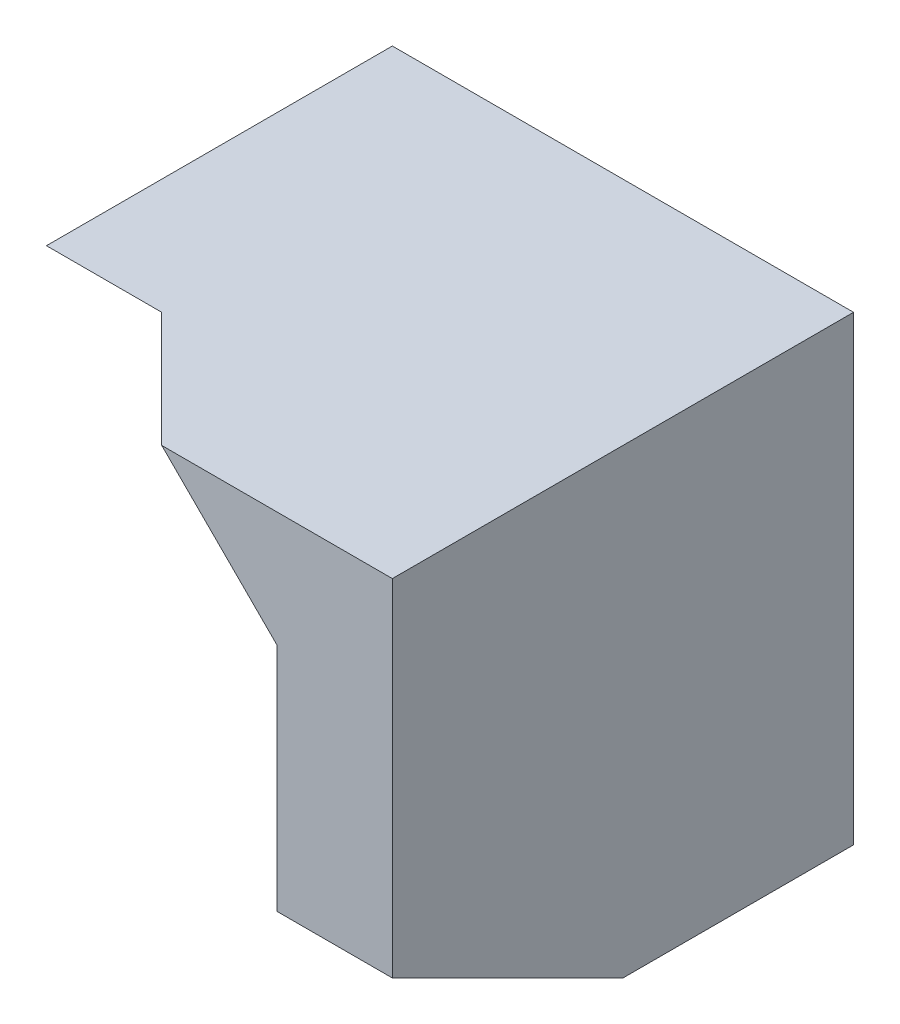
ISO-10303-21;
HEADER;
FILE_DESCRIPTION(('STEP AP214'),'2;1');
FILE_NAME('part.step','',(''),(''),'','','');
FILE_SCHEMA(('AUTOMOTIVE_DESIGN { 1 0 10303 214 1 1 1 1 }'));
ENDSEC;
DATA;
#1=APPLICATION_CONTEXT('core data for automotive mechanical design processes');
#2=APPLICATION_PROTOCOL_DEFINITION('international standard','automotive_design',2000,#1);
#3=PRODUCT_CONTEXT('',#1,'mechanical');
#4=PRODUCT('Part','Part','',(#3));
#5=PRODUCT_RELATED_PRODUCT_CATEGORY('part','',(#4));
#6=PRODUCT_DEFINITION_FORMATION('','',#4);
#7=PRODUCT_DEFINITION_CONTEXT('part definition',#1,'design');
#8=PRODUCT_DEFINITION('design','',#6,#7);
#9=PRODUCT_DEFINITION_SHAPE('','',#8);
#10=(LENGTH_UNIT() NAMED_UNIT(*) SI_UNIT(.MILLI.,.METRE.));
#11=(NAMED_UNIT(*) PLANE_ANGLE_UNIT() SI_UNIT($,.RADIAN.));
#12=(NAMED_UNIT(*) SI_UNIT($,.STERADIAN.) SOLID_ANGLE_UNIT());
#13=UNCERTAINTY_MEASURE_WITH_UNIT(LENGTH_MEASURE(1.E-05),#10,'distance_accuracy_value','');
#14=(GEOMETRIC_REPRESENTATION_CONTEXT(3) GLOBAL_UNCERTAINTY_ASSIGNED_CONTEXT((#13)) GLOBAL_UNIT_ASSIGNED_CONTEXT((#10,
#11,#12)) REPRESENTATION_CONTEXT('',''));
#15=CARTESIAN_POINT('',(0.,0.,0.));
#16=DIRECTION('',(0.,0.,1.));
#17=DIRECTION('',(1.,0.,0.));
#18=AXIS2_PLACEMENT_3D('',#15,#16,#17);
#19=CARTESIAN_POINT('',(30.,40.,40.));
#20=DIRECTION('',(0.,0.,1.));
#21=DIRECTION('',(0.,-1.,0.));
#22=AXIS2_PLACEMENT_3D('',#19,#20,#21);
#23=PLANE('',#22);
#24=DIRECTION('',(1.,0.,0.));
#25=VECTOR('',#24,1.);
#26=CARTESIAN_POINT('',(30.,40.,40.));
#27=LINE('',#26,#25);
#28=CARTESIAN_POINT('',(20.,40.,40.));
#29=VERTEX_POINT('',#28);
#30=CARTESIAN_POINT('',(40.,40.,40.));
#31=VERTEX_POINT('',#30);
#32=EDGE_CURVE('E156',#29,#31,#27,.T.);
#33=ORIENTED_EDGE('',*,*,#32,.F.);
#34=DIRECTION('',(0.707106781186547,-0.707106781186548,0.));
#35=VECTOR('',#34,1.);
#36=CARTESIAN_POINT('',(20.,40.,40.));
#37=LINE('',#36,#35);
#38=CARTESIAN_POINT('',(30.,30.,40.));
#39=VERTEX_POINT('',#38);
#40=EDGE_CURVE('E142',#29,#39,#37,.T.);
#41=ORIENTED_EDGE('',*,*,#40,.T.);
#42=DIRECTION('',(0.,-1.,0.));
#43=VECTOR('',#42,1.);
#44=CARTESIAN_POINT('',(30.,40.,40.));
#45=LINE('',#44,#43);
#46=CARTESIAN_POINT('',(30.,10.,40.));
#47=VERTEX_POINT('',#46);
#48=EDGE_CURVE('E150',#39,#47,#45,.T.);
#49=ORIENTED_EDGE('',*,*,#48,.T.);
#50=DIRECTION('',(1.,0.,0.));
#51=VECTOR('',#50,1.);
#52=CARTESIAN_POINT('',(30.,10.,40.));
#53=LINE('',#52,#51);
#54=CARTESIAN_POINT('',(40.,10.,40.));
#55=VERTEX_POINT('',#54);
#56=EDGE_CURVE('E223',#47,#55,#53,.T.);
#57=ORIENTED_EDGE('',*,*,#56,.T.);
#58=DIRECTION('',(0.,-1.,0.));
#59=VECTOR('',#58,1.);
#60=CARTESIAN_POINT('',(40.,40.,40.));
#61=LINE('',#60,#59);
#62=EDGE_CURVE('E161',#31,#55,#61,.T.);
#63=ORIENTED_EDGE('',*,*,#62,.F.);
#64=EDGE_LOOP('',(#33,#41,#49,#57,#63));
#65=FACE_BOUND('',#64,.T.);
#66=ADVANCED_FACE('F36',(#65),#23,.T.);
#67=CARTESIAN_POINT('',(6.66666666666667,6.66666666666666,-6.66666666666666));
#68=DIRECTION('',(-0.577350269189626,-0.577350269189626,0.577350269189626));
#69=DIRECTION('',(0.707106781186547,0.,0.707106781186548));
#70=AXIS2_PLACEMENT_3D('',#67,#68,#69);
#71=PLANE('',#70);
#72=ORIENTED_EDGE('',*,*,#40,.F.);
#73=DIRECTION('',(-0.707106781186547,0.,-0.707106781186547));
#74=VECTOR('',#73,1.);
#75=CARTESIAN_POINT('',(20.,40.,40.));
#76=LINE('',#75,#74);
#77=CARTESIAN_POINT('',(9.99999999999999,40.,30.));
#78=VERTEX_POINT('',#77);
#79=EDGE_CURVE('E46',#29,#78,#76,.T.);
#80=ORIENTED_EDGE('',*,*,#79,.T.);
#81=DIRECTION('',(0.,-0.707106781186548,-0.707106781186548));
#82=VECTOR('',#81,1.);
#83=CARTESIAN_POINT('',(10.,40.,30.));
#84=LINE('',#83,#82);
#85=CARTESIAN_POINT('',(9.99999999999999,30.,20.));
#86=VERTEX_POINT('',#85);
#87=EDGE_CURVE('E12',#78,#86,#84,.T.);
#88=ORIENTED_EDGE('',*,*,#87,.T.);
#89=DIRECTION('',(-0.707106781186548,0.707106781186548,0.));
#90=VECTOR('',#89,1.);
#91=CARTESIAN_POINT('',(10.,30.,20.));
#92=LINE('',#91,#90);
#93=CARTESIAN_POINT('',(20.,20.,20.));
#94=VERTEX_POINT('',#93);
#95=EDGE_CURVE('E197',#94,#86,#92,.T.);
#96=ORIENTED_EDGE('',*,*,#95,.F.);
#97=DIRECTION('',(-0.707106781186548,0.707106781186546,0.));
#98=VECTOR('',#97,1.);
#99=CARTESIAN_POINT('',(10.,30.,20.));
#100=LINE('',#99,#98);
#101=CARTESIAN_POINT('',(29.9999999999999,10.0000000000001,20.0000000000001));
#102=VERTEX_POINT('',#101);
#103=EDGE_CURVE('E217',#102,#94,#100,.T.);
#104=ORIENTED_EDGE('',*,*,#103,.F.);
#105=DIRECTION('',(0.,-0.707106781186546,-0.707106781186549));
#106=VECTOR('',#105,1.);
#107=CARTESIAN_POINT('',(29.9999999999999,10.0000000000001,20.0000000000001));
#108=LINE('',#107,#106);
#109=EDGE_CURVE('E146',#39,#102,#108,.T.);
#110=ORIENTED_EDGE('',*,*,#109,.F.);
#111=EDGE_LOOP('',(#72,#80,#88,#96,#104,#110));
#112=FACE_BOUND('',#111,.T.);
#113=ADVANCED_FACE('F144',(#112),#71,.T.);
#114=CARTESIAN_POINT('',(10.,30.,20.));
#115=DIRECTION('',(0.,1.,0.));
#116=DIRECTION('',(0.,0.,1.));
#117=AXIS2_PLACEMENT_3D('',#114,#115,#116);
#118=PLANE('',#117);
#119=DIRECTION('',(0.,0.,-1.));
#120=VECTOR('',#119,1.);
#121=CARTESIAN_POINT('',(10.,30.,20.));
#122=LINE('',#121,#120);
#123=CARTESIAN_POINT('',(10.,30.,10.));
#124=VERTEX_POINT('',#123);
#125=EDGE_CURVE('E196',#86,#124,#122,.T.);
#126=ORIENTED_EDGE('',*,*,#125,.F.);
#127=DIRECTION('',(-1.,0.,0.));
#128=VECTOR('',#127,1.);
#129=CARTESIAN_POINT('',(10.,30.,20.));
#130=LINE('',#129,#128);
#131=CARTESIAN_POINT('',(0.,30.,20.));
#132=VERTEX_POINT('',#131);
#133=EDGE_CURVE('E167',#86,#132,#130,.T.);
#134=ORIENTED_EDGE('',*,*,#133,.T.);
#135=DIRECTION('',(0.,0.,-1.));
#136=VECTOR('',#135,1.);
#137=CARTESIAN_POINT('',(0.,30.,20.));
#138=LINE('',#137,#136);
#139=CARTESIAN_POINT('',(0.,30.,10.));
#140=VERTEX_POINT('',#139);
#141=EDGE_CURVE('E163',#132,#140,#138,.T.);
#142=ORIENTED_EDGE('',*,*,#141,.T.);
#143=DIRECTION('',(-1.,0.,0.));
#144=VECTOR('',#143,1.);
#145=CARTESIAN_POINT('',(10.,30.,10.));
#146=LINE('',#145,#144);
#147=EDGE_CURVE('E202',#124,#140,#146,.T.);
#148=ORIENTED_EDGE('',*,*,#147,.F.);
#149=EDGE_LOOP('',(#126,#134,#142,#148));
#150=FACE_BOUND('',#149,.T.);
#151=ADVANCED_FACE('F232',(#150),#118,.F.);
#152=CARTESIAN_POINT('',(0.,40.,20.));
#153=DIRECTION('',(0.,-1.,0.));
#154=DIRECTION('',(0.,0.,-1.));
#155=AXIS2_PLACEMENT_3D('',#152,#153,#154);
#156=PLANE('',#155);
#157=ORIENTED_EDGE('',*,*,#79,.F.);
#158=ORIENTED_EDGE('',*,*,#32,.T.);
#159=DIRECTION('',(0.,0.,-1.));
#160=VECTOR('',#159,1.);
#161=CARTESIAN_POINT('',(40.,40.,20.));
#162=LINE('',#161,#160);
#163=CARTESIAN_POINT('',(40.,40.,0.));
#164=VERTEX_POINT('',#163);
#165=EDGE_CURVE('E162',#31,#164,#162,.T.);
#166=ORIENTED_EDGE('',*,*,#165,.T.);
#167=DIRECTION('',(-1.,0.,0.));
#168=VECTOR('',#167,1.);
#169=CARTESIAN_POINT('',(0.,40.,0.));
#170=LINE('',#169,#168);
#171=CARTESIAN_POINT('',(0.,40.,0.));
#172=VERTEX_POINT('',#171);
#173=EDGE_CURVE('E165',#164,#172,#170,.T.);
#174=ORIENTED_EDGE('',*,*,#173,.T.);
#175=DIRECTION('',(0.,0.,-1.));
#176=VECTOR('',#175,1.);
#177=CARTESIAN_POINT('',(0.,40.,20.));
#178=LINE('',#177,#176);
#179=CARTESIAN_POINT('',(0.,40.,30.));
#180=VERTEX_POINT('',#179);
#181=EDGE_CURVE('E361',#180,#172,#178,.T.);
#182=ORIENTED_EDGE('',*,*,#181,.F.);
#183=DIRECTION('',(-1.,0.,0.));
#184=VECTOR('',#183,1.);
#185=CARTESIAN_POINT('',(10.,40.,30.));
#186=LINE('',#185,#184);
#187=EDGE_CURVE('E59',#78,#180,#186,.T.);
#188=ORIENTED_EDGE('',*,*,#187,.F.);
#189=EDGE_LOOP('',(#157,#158,#166,#174,#182,#188));
#190=FACE_BOUND('',#189,.T.);
#191=ADVANCED_FACE('F154',(#190),#156,.F.);
#192=CARTESIAN_POINT('',(0.,0.,20.));
#193=DIRECTION('',(1.,0.,0.));
#194=DIRECTION('',(0.,0.,-1.));
#195=AXIS2_PLACEMENT_3D('',#192,#193,#194);
#196=PLANE('',#195);
#197=ORIENTED_EDGE('',*,*,#141,.F.);
#198=DIRECTION('',(0.,-0.707106781186548,-0.707106781186548));
#199=VECTOR('',#198,1.);
#200=CARTESIAN_POINT('',(0.,40.,30.));
#201=LINE('',#200,#199);
#202=EDGE_CURVE('E179',#180,#132,#201,.T.);
#203=ORIENTED_EDGE('',*,*,#202,.F.);
#204=ORIENTED_EDGE('',*,*,#181,.T.);
#205=DIRECTION('',(0.,-1.,0.));
#206=VECTOR('',#205,1.);
#207=CARTESIAN_POINT('',(0.,0.,0.));
#208=LINE('',#207,#206);
#209=CARTESIAN_POINT('',(0.,20.,0.));
#210=VERTEX_POINT('',#209);
#211=EDGE_CURVE('E357',#172,#210,#208,.T.);
#212=ORIENTED_EDGE('',*,*,#211,.T.);
#213=DIRECTION('',(0.,0.,1.));
#214=VECTOR('',#213,1.);
#215=CARTESIAN_POINT('',(0.,20.,0.));
#216=LINE('',#215,#214);
#217=CARTESIAN_POINT('',(0.,20.,10.));
#218=VERTEX_POINT('',#217);
#219=EDGE_CURVE('E242',#210,#218,#216,.T.);
#220=ORIENTED_EDGE('',*,*,#219,.T.);
#221=DIRECTION('',(0.,-1.,0.));
#222=VECTOR('',#221,1.);
#223=CARTESIAN_POINT('',(0.,20.,10.));
#224=LINE('',#223,#222);
#225=EDGE_CURVE('E209',#140,#218,#224,.T.);
#226=ORIENTED_EDGE('',*,*,#225,.F.);
#227=EDGE_LOOP('',(#197,#203,#204,#212,#220,#226));
#228=FACE_BOUND('',#227,.T.);
#229=ADVANCED_FACE('F238',(#228),#196,.F.);
#230=CARTESIAN_POINT('',(0.,0.,20.));
#231=DIRECTION('',(0.,1.,0.));
#232=DIRECTION('',(0.,0.,1.));
#233=AXIS2_PLACEMENT_3D('',#230,#231,#232);
#234=PLANE('',#233);
#235=DIRECTION('',(1.,0.,0.));
#236=VECTOR('',#235,1.);
#237=CARTESIAN_POINT('',(0.,0.,20.));
#238=LINE('',#237,#236);
#239=CARTESIAN_POINT('',(30.,0.,20.));
#240=VERTEX_POINT('',#239);
#241=CARTESIAN_POINT('',(40.,0.,20.));
#242=VERTEX_POINT('',#241);
#243=EDGE_CURVE('E151',#240,#242,#238,.T.);
#244=ORIENTED_EDGE('',*,*,#243,.F.);
#245=DIRECTION('',(0.,0.,1.));
#246=VECTOR('',#245,1.);
#247=CARTESIAN_POINT('',(30.,0.,0.));
#248=LINE('',#247,#246);
#249=CARTESIAN_POINT('',(30.,0.,0.));
#250=VERTEX_POINT('',#249);
#251=EDGE_CURVE('E339',#250,#240,#248,.T.);
#252=ORIENTED_EDGE('',*,*,#251,.F.);
#253=DIRECTION('',(1.,0.,0.));
#254=VECTOR('',#253,1.);
#255=CARTESIAN_POINT('',(0.,0.,0.));
#256=LINE('',#255,#254);
#257=CARTESIAN_POINT('',(40.,0.,0.));
#258=VERTEX_POINT('',#257);
#259=EDGE_CURVE('E360',#250,#258,#256,.T.);
#260=ORIENTED_EDGE('',*,*,#259,.T.);
#261=DIRECTION('',(0.,0.,-1.));
#262=VECTOR('',#261,1.);
#263=CARTESIAN_POINT('',(40.,0.,20.));
#264=LINE('',#263,#262);
#265=EDGE_CURVE('E257',#242,#258,#264,.T.);
#266=ORIENTED_EDGE('',*,*,#265,.F.);
#267=EDGE_LOOP('',(#244,#252,#260,#266));
#268=FACE_BOUND('',#267,.T.);
#269=ADVANCED_FACE('F375',(#268),#234,.F.);
#270=CARTESIAN_POINT('',(40.,0.,20.));
#271=DIRECTION('',(-1.,0.,0.));
#272=DIRECTION('',(0.,0.,1.));
#273=AXIS2_PLACEMENT_3D('',#270,#271,#272);
#274=PLANE('',#273);
#275=DIRECTION('',(0.,1.,0.));
#276=VECTOR('',#275,1.);
#277=CARTESIAN_POINT('',(40.,0.,0.));
#278=LINE('',#277,#276);
#279=EDGE_CURVE('E259',#258,#164,#278,.T.);
#280=ORIENTED_EDGE('',*,*,#279,.T.);
#281=ORIENTED_EDGE('',*,*,#165,.F.);
#282=ORIENTED_EDGE('',*,*,#62,.T.);
#283=DIRECTION('',(0.,-0.447213595499958,-0.894427190999916));
#284=VECTOR('',#283,1.);
#285=CARTESIAN_POINT('',(40.,10.,40.));
#286=LINE('',#285,#284);
#287=EDGE_CURVE('E254',#55,#242,#286,.T.);
#288=ORIENTED_EDGE('',*,*,#287,.T.);
#289=ORIENTED_EDGE('',*,*,#265,.T.);
#290=EDGE_LOOP('',(#280,#281,#282,#288,#289));
#291=FACE_BOUND('',#290,.T.);
#292=ADVANCED_FACE('F294',(#291),#274,.F.);
#293=CARTESIAN_POINT('',(0.,0.,20.));
#294=DIRECTION('',(0.,0.,-1.));
#295=DIRECTION('',(-1.,0.,0.));
#296=AXIS2_PLACEMENT_3D('',#293,#294,#295);
#297=PLANE('',#296);
#298=DIRECTION('',(0.,1.,0.));
#299=VECTOR('',#298,1.);
#300=CARTESIAN_POINT('',(30.,40.,20.));
#301=LINE('',#300,#299);
#302=EDGE_CURVE('E221',#240,#102,#301,.T.);
#303=ORIENTED_EDGE('',*,*,#302,.T.);
#304=ORIENTED_EDGE('',*,*,#103,.T.);
#305=DIRECTION('',(0.,1.,0.));
#306=VECTOR('',#305,1.);
#307=CARTESIAN_POINT('',(20.,20.,20.));
#308=LINE('',#307,#306);
#309=CARTESIAN_POINT('',(20.,9.99999999999999,20.));
#310=VERTEX_POINT('',#309);
#311=EDGE_CURVE('E183',#310,#94,#308,.T.);
#312=ORIENTED_EDGE('',*,*,#311,.F.);
#313=DIRECTION('',(-0.707106781186548,0.707106781186548,0.));
#314=VECTOR('',#313,1.);
#315=CARTESIAN_POINT('',(15.,15.,20.));
#316=LINE('',#315,#314);
#317=EDGE_CURVE('E337',#240,#310,#316,.T.);
#318=ORIENTED_EDGE('',*,*,#317,.F.);
#319=EDGE_LOOP('',(#303,#304,#312,#318));
#320=FACE_BOUND('',#319,.T.);
#321=ADVANCED_FACE('F282',(#320),#297,.F.);
#322=CARTESIAN_POINT('',(0.,0.,0.));
#323=DIRECTION('',(0.,0.,-1.));
#324=DIRECTION('',(-1.,0.,0.));
#325=AXIS2_PLACEMENT_3D('',#322,#323,#324);
#326=PLANE('',#325);
#327=ORIENTED_EDGE('',*,*,#211,.F.);
#328=ORIENTED_EDGE('',*,*,#173,.F.);
#329=ORIENTED_EDGE('',*,*,#279,.F.);
#330=ORIENTED_EDGE('',*,*,#259,.F.);
#331=DIRECTION('',(-0.707106781186548,0.707106781186548,0.));
#332=VECTOR('',#331,1.);
#333=CARTESIAN_POINT('',(15.,15.,0.));
#334=LINE('',#333,#332);
#335=CARTESIAN_POINT('',(10.,20.,0.));
#336=VERTEX_POINT('',#335);
#337=EDGE_CURVE('E220',#250,#336,#334,.T.);
#338=ORIENTED_EDGE('',*,*,#337,.T.);
#339=DIRECTION('',(-1.,0.,0.));
#340=VECTOR('',#339,1.);
#341=CARTESIAN_POINT('',(0.,20.,0.));
#342=LINE('',#341,#340);
#343=EDGE_CURVE('E342',#336,#210,#342,.T.);
#344=ORIENTED_EDGE('',*,*,#343,.T.);
#345=EDGE_LOOP('',(#327,#328,#329,#330,#338,#344));
#346=FACE_BOUND('',#345,.T.);
#347=ADVANCED_FACE('F293',(#346),#326,.T.);
#348=CARTESIAN_POINT('',(15.,15.,0.));
#349=DIRECTION('',(0.707106781186548,0.707106781186548,0.));
#350=DIRECTION('',(-0.707106781186548,0.707106781186548,0.));
#351=AXIS2_PLACEMENT_3D('',#348,#349,#350);
#352=PLANE('',#351);
#353=ORIENTED_EDGE('',*,*,#317,.T.);
#354=DIRECTION('',(0.,0.,1.));
#355=VECTOR('',#354,1.);
#356=CARTESIAN_POINT('',(20.,9.99999999999999,10.));
#357=LINE('',#356,#355);
#358=CARTESIAN_POINT('',(20.,9.99999999999999,10.));
#359=VERTEX_POINT('',#358);
#360=EDGE_CURVE('E181',#359,#310,#357,.T.);
#361=ORIENTED_EDGE('',*,*,#360,.F.);
#362=DIRECTION('',(0.707106781186547,-0.707106781186547,0.));
#363=VECTOR('',#362,1.);
#364=CARTESIAN_POINT('',(10.,20.,10.));
#365=LINE('',#364,#363);
#366=CARTESIAN_POINT('',(10.,20.,10.));
#367=VERTEX_POINT('',#366);
#368=EDGE_CURVE('E206',#367,#359,#365,.T.);
#369=ORIENTED_EDGE('',*,*,#368,.F.);
#370=DIRECTION('',(0.,0.,1.));
#371=VECTOR('',#370,1.);
#372=CARTESIAN_POINT('',(10.,20.,0.));
#373=LINE('',#372,#371);
#374=EDGE_CURVE('E248',#336,#367,#373,.T.);
#375=ORIENTED_EDGE('',*,*,#374,.F.);
#376=ORIENTED_EDGE('',*,*,#337,.F.);
#377=ORIENTED_EDGE('',*,*,#251,.T.);
#378=EDGE_LOOP('',(#353,#361,#369,#375,#376,#377));
#379=FACE_BOUND('',#378,.T.);
#380=ADVANCED_FACE('F326',(#379),#352,.F.);
#381=CARTESIAN_POINT('',(0.,20.,0.));
#382=DIRECTION('',(0.,1.,0.));
#383=DIRECTION('',(0.,0.,1.));
#384=AXIS2_PLACEMENT_3D('',#381,#382,#383);
#385=PLANE('',#384);
#386=ORIENTED_EDGE('',*,*,#374,.T.);
#387=DIRECTION('',(-1.,0.,0.));
#388=VECTOR('',#387,1.);
#389=CARTESIAN_POINT('',(10.,20.,10.));
#390=LINE('',#389,#388);
#391=EDGE_CURVE('E246',#367,#218,#390,.T.);
#392=ORIENTED_EDGE('',*,*,#391,.T.);
#393=ORIENTED_EDGE('',*,*,#219,.F.);
#394=ORIENTED_EDGE('',*,*,#343,.F.);
#395=EDGE_LOOP('',(#386,#392,#393,#394));
#396=FACE_BOUND('',#395,.T.);
#397=ADVANCED_FACE('F322',(#396),#385,.F.);
#398=CARTESIAN_POINT('',(10.,20.,10.));
#399=DIRECTION('',(0.,0.,-1.));
#400=DIRECTION('',(-1.,0.,0.));
#401=AXIS2_PLACEMENT_3D('',#398,#399,#400);
#402=PLANE('',#401);
#403=ORIENTED_EDGE('',*,*,#225,.T.);
#404=ORIENTED_EDGE('',*,*,#391,.F.);
#405=ORIENTED_EDGE('',*,*,#368,.T.);
#406=DIRECTION('',(0.,1.,0.));
#407=VECTOR('',#406,1.);
#408=CARTESIAN_POINT('',(20.,20.,10.));
#409=LINE('',#408,#407);
#410=CARTESIAN_POINT('',(20.,20.,10.));
#411=VERTEX_POINT('',#410);
#412=EDGE_CURVE('E203',#359,#411,#409,.T.);
#413=ORIENTED_EDGE('',*,*,#412,.T.);
#414=DIRECTION('',(-0.707106781186548,0.707106781186548,0.));
#415=VECTOR('',#414,1.);
#416=CARTESIAN_POINT('',(10.,30.,10.));
#417=LINE('',#416,#415);
#418=EDGE_CURVE('E200',#411,#124,#417,.T.);
#419=ORIENTED_EDGE('',*,*,#418,.T.);
#420=ORIENTED_EDGE('',*,*,#147,.T.);
#421=EDGE_LOOP('',(#403,#404,#405,#413,#419,#420));
#422=FACE_BOUND('',#421,.T.);
#423=ADVANCED_FACE('F316',(#422),#402,.F.);
#424=CARTESIAN_POINT('',(30.,10.,40.));
#425=DIRECTION('',(0.,-0.894427190999916,0.447213595499958));
#426=DIRECTION('',(0.,-0.447213595499958,-0.894427190999916));
#427=AXIS2_PLACEMENT_3D('',#424,#425,#426);
#428=PLANE('',#427);
#429=ORIENTED_EDGE('',*,*,#287,.F.);
#430=ORIENTED_EDGE('',*,*,#56,.F.);
#431=DIRECTION('',(0.,-0.447213595499958,-0.894427190999916));
#432=VECTOR('',#431,1.);
#433=CARTESIAN_POINT('',(30.,10.,40.));
#434=LINE('',#433,#432);
#435=EDGE_CURVE('E261',#47,#240,#434,.T.);
#436=ORIENTED_EDGE('',*,*,#435,.T.);
#437=ORIENTED_EDGE('',*,*,#243,.T.);
#438=EDGE_LOOP('',(#429,#430,#436,#437));
#439=FACE_BOUND('',#438,.T.);
#440=ADVANCED_FACE('F312',(#439),#428,.T.);
#441=CARTESIAN_POINT('',(30.,0.,0.));
#442=DIRECTION('',(1.,0.,0.));
#443=DIRECTION('',(0.,0.,-1.));
#444=AXIS2_PLACEMENT_3D('',#441,#442,#443);
#445=PLANE('',#444);
#446=ORIENTED_EDGE('',*,*,#435,.F.);
#447=ORIENTED_EDGE('',*,*,#48,.F.);
#448=ORIENTED_EDGE('',*,*,#109,.T.);
#449=ORIENTED_EDGE('',*,*,#302,.F.);
#450=EDGE_LOOP('',(#446,#447,#448,#449));
#451=FACE_BOUND('',#450,.T.);
#452=ADVANCED_FACE('F289',(#451),#445,.F.);
#453=CARTESIAN_POINT('',(10.,30.,10.));
#454=DIRECTION('',(0.707106781186548,0.707106781186548,0.));
#455=DIRECTION('',(-0.707106781186548,0.707106781186548,0.));
#456=AXIS2_PLACEMENT_3D('',#453,#454,#455);
#457=PLANE('',#456);
#458=ORIENTED_EDGE('',*,*,#95,.T.);
#459=ORIENTED_EDGE('',*,*,#125,.T.);
#460=ORIENTED_EDGE('',*,*,#418,.F.);
#461=DIRECTION('',(0.,0.,1.));
#462=VECTOR('',#461,1.);
#463=CARTESIAN_POINT('',(20.,20.,10.));
#464=LINE('',#463,#462);
#465=EDGE_CURVE('E189',#411,#94,#464,.T.);
#466=ORIENTED_EDGE('',*,*,#465,.T.);
#467=EDGE_LOOP('',(#458,#459,#460,#466));
#468=FACE_BOUND('',#467,.T.);
#469=ADVANCED_FACE('F304',(#468),#457,.F.);
#470=CARTESIAN_POINT('',(20.,20.,10.));
#471=DIRECTION('',(1.,0.,0.));
#472=DIRECTION('',(0.,0.,-1.));
#473=AXIS2_PLACEMENT_3D('',#470,#471,#472);
#474=PLANE('',#473);
#475=ORIENTED_EDGE('',*,*,#311,.T.);
#476=ORIENTED_EDGE('',*,*,#465,.F.);
#477=ORIENTED_EDGE('',*,*,#412,.F.);
#478=ORIENTED_EDGE('',*,*,#360,.T.);
#479=EDGE_LOOP('',(#475,#476,#477,#478));
#480=FACE_BOUND('',#479,.T.);
#481=ADVANCED_FACE('F307',(#480),#474,.F.);
#482=CARTESIAN_POINT('',(10.,40.,30.));
#483=DIRECTION('',(0.,0.707106781186548,-0.707106781186548));
#484=DIRECTION('',(0.,0.707106781186548,0.707106781186548));
#485=AXIS2_PLACEMENT_3D('',#482,#483,#484);
#486=PLANE('',#485);
#487=ORIENTED_EDGE('',*,*,#202,.T.);
#488=ORIENTED_EDGE('',*,*,#133,.F.);
#489=ORIENTED_EDGE('',*,*,#87,.F.);
#490=ORIENTED_EDGE('',*,*,#187,.T.);
#491=EDGE_LOOP('',(#487,#488,#489,#490));
#492=FACE_BOUND('',#491,.T.);
#493=ADVANCED_FACE('F38',(#492),#486,.F.);
#494=CLOSED_SHELL('',(#66,#113,#151,#191,#229,#269,#292,#321,#347,#380,#397,#423,#440,#452,#469,
#481,#493));
#495=CARTESIAN_POINT('',(12.4401693585629,12.4401693585629,-12.4401693585629));
#496=DIRECTION('',(-0.577350269189626,-0.577350269189626,0.577350269189626));
#497=DIRECTION('',(0.707106781186547,0.,0.707106781186548));
#498=AXIS2_PLACEMENT_3D('',#495,#496,#497);
#499=PLANE('',#498);
#500=DIRECTION('',(-0.707106781186547,0.707106781186548,0.));
#501=VECTOR('',#500,1.);
#502=CARTESIAN_POINT('',(28.6602540378444,28.6602540378444,20.));
#503=LINE('',#502,#501);
#504=CARTESIAN_POINT('',(30.,27.3205080756888,20.));
#505=VERTEX_POINT('',#504);
#506=CARTESIAN_POINT('',(27.3205080756888,30.,20.));
#507=VERTEX_POINT('',#506);
#508=EDGE_CURVE('E210',#505,#507,#503,.T.);
#509=ORIENTED_EDGE('',*,*,#508,.T.);
#510=DIRECTION('',(0.707106781186547,0.,0.707106781186548));
#511=VECTOR('',#510,1.);
#512=CARTESIAN_POINT('',(3.66025403784439,30.,-3.66025403784439));
#513=LINE('',#512,#511);
#514=CARTESIAN_POINT('',(30.,30.,22.6794919243112));
#515=VERTEX_POINT('',#514);
#516=EDGE_CURVE('E213',#507,#515,#513,.T.);
#517=ORIENTED_EDGE('',*,*,#516,.T.);
#518=DIRECTION('',(0.,-0.707106781186548,-0.707106781186547));
#519=VECTOR('',#518,1.);
#520=CARTESIAN_POINT('',(30.,3.66025403784437,-3.66025403784437));
#521=LINE('',#520,#519);
#522=EDGE_CURVE('E214',#515,#505,#521,.T.);
#523=ORIENTED_EDGE('',*,*,#522,.T.);
#524=EDGE_LOOP('',(#509,#517,#523));
#525=FACE_BOUND('',#524,.T.);
#526=ADVANCED_FACE('F276',(#525),#499,.F.);
#527=ORIENTED_EDGE('',*,*,#522,.F.);
#528=DIRECTION('',(0.,0.,-1.));
#529=VECTOR('',#528,1.);
#530=CARTESIAN_POINT('',(30.,30.,0.));
#531=LINE('',#530,#529);
#532=CARTESIAN_POINT('',(30.,30.,20.));
#533=VERTEX_POINT('',#532);
#534=EDGE_CURVE('E216',#515,#533,#531,.T.);
#535=ORIENTED_EDGE('',*,*,#534,.T.);
#536=EDGE_CURVE('E228',#505,#533,#301,.T.);
#537=ORIENTED_EDGE('',*,*,#536,.F.);
#538=EDGE_LOOP('',(#527,#535,#537));
#539=FACE_BOUND('',#538,.T.);
#540=ADVANCED_FACE('F272',(#539),#445,.F.);
#541=ORIENTED_EDGE('',*,*,#536,.T.);
#542=DIRECTION('',(-1.,0.,0.));
#543=VECTOR('',#542,1.);
#544=CARTESIAN_POINT('',(30.,30.,20.));
#545=LINE('',#544,#543);
#546=EDGE_CURVE('E226',#533,#507,#545,.T.);
#547=ORIENTED_EDGE('',*,*,#546,.T.);
#548=ORIENTED_EDGE('',*,*,#508,.F.);
#549=EDGE_LOOP('',(#541,#547,#548));
#550=FACE_BOUND('',#549,.T.);
#551=ADVANCED_FACE('F279',(#550),#297,.F.);
#552=CARTESIAN_POINT('',(30.,30.,20.));
#553=DIRECTION('',(0.,-1.,0.));
#554=DIRECTION('',(0.,0.,-1.));
#555=AXIS2_PLACEMENT_3D('',#552,#553,#554);
#556=PLANE('',#555);
#557=ORIENTED_EDGE('',*,*,#516,.F.);
#558=ORIENTED_EDGE('',*,*,#546,.F.);
#559=ORIENTED_EDGE('',*,*,#534,.F.);
#560=EDGE_LOOP('',(#557,#558,#559));
#561=FACE_BOUND('',#560,.T.);
#562=ADVANCED_FACE('F274',(#561),#556,.T.);
#563=CLOSED_SHELL('',(#526,#540,#551,#562));
#564=ORIENTED_CLOSED_SHELL('',*,#563,.T.);
#565=BREP_WITH_VOIDS('B2',#494,(#564));
#566=ADVANCED_BREP_SHAPE_REPRESENTATION('',(#18,#565),#14);
#567=SHAPE_DEFINITION_REPRESENTATION(#9,#566);
ENDSEC;
END-ISO-10303-21;
